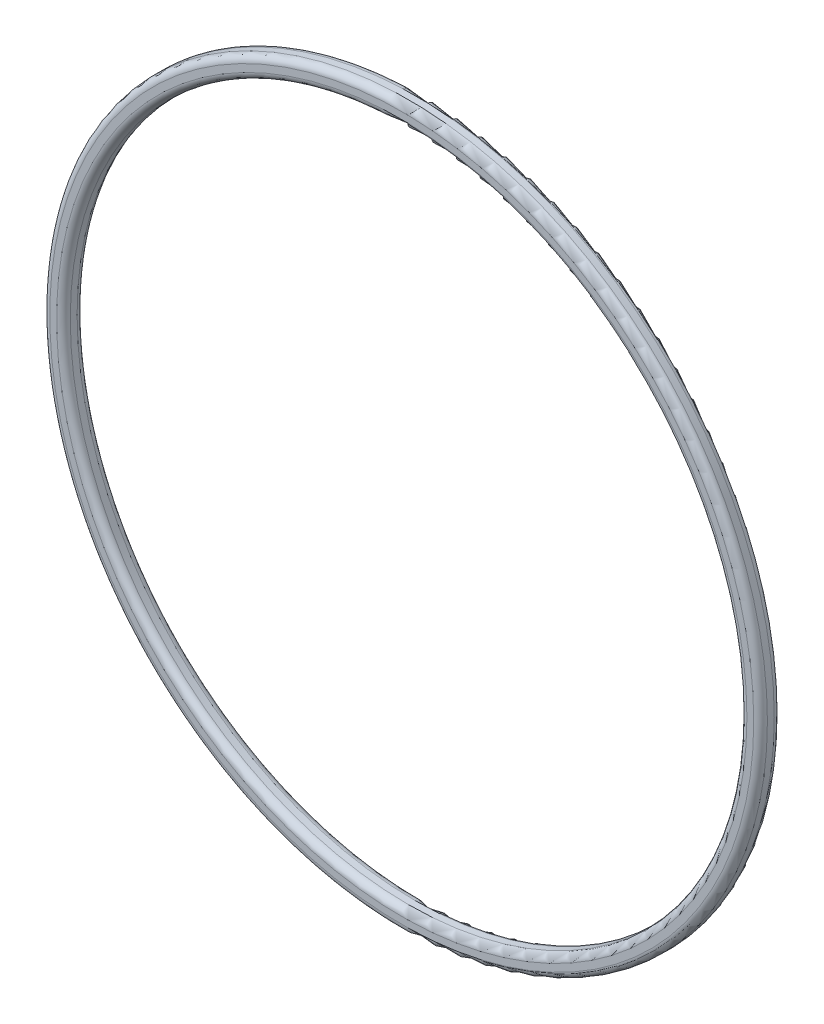
ISO-10303-21;
HEADER;
FILE_DESCRIPTION(('STEP AP214'),'2;1');
FILE_NAME('part.step','',(''),(''),'','','');
FILE_SCHEMA(('AUTOMOTIVE_DESIGN { 1 0 10303 214 1 1 1 1 }'));
ENDSEC;
DATA;
#1=APPLICATION_CONTEXT('core data for automotive mechanical design processes');
#2=APPLICATION_PROTOCOL_DEFINITION('international standard','automotive_design',2000,#1);
#3=PRODUCT_CONTEXT('',#1,'mechanical');
#4=PRODUCT('Part','Part','',(#3));
#5=PRODUCT_RELATED_PRODUCT_CATEGORY('part','',(#4));
#6=PRODUCT_DEFINITION_FORMATION('','',#4);
#7=PRODUCT_DEFINITION_CONTEXT('part definition',#1,'design');
#8=PRODUCT_DEFINITION('design','',#6,#7);
#9=PRODUCT_DEFINITION_SHAPE('','',#8);
#10=(LENGTH_UNIT() NAMED_UNIT(*) SI_UNIT(.MILLI.,.METRE.));
#11=(NAMED_UNIT(*) PLANE_ANGLE_UNIT() SI_UNIT($,.RADIAN.));
#12=(NAMED_UNIT(*) SI_UNIT($,.STERADIAN.) SOLID_ANGLE_UNIT());
#13=UNCERTAINTY_MEASURE_WITH_UNIT(LENGTH_MEASURE(1.E-05),#10,'distance_accuracy_value','');
#14=(GEOMETRIC_REPRESENTATION_CONTEXT(3) GLOBAL_UNCERTAINTY_ASSIGNED_CONTEXT((#13)) GLOBAL_UNIT_ASSIGNED_CONTEXT((#10,
#11,#12)) REPRESENTATION_CONTEXT('',''));
#15=CARTESIAN_POINT('',(0.,0.,0.));
#16=DIRECTION('',(0.,0.,1.));
#17=DIRECTION('',(1.,0.,0.));
#18=AXIS2_PLACEMENT_3D('',#15,#16,#17);
#19=CARTESIAN_POINT('',(0.,0.,3.));
#20=DIRECTION('',(0.,0.,1.));
#21=DIRECTION('',(1.,0.,0.));
#22=AXIS2_PLACEMENT_3D('',#19,#20,#21);
#23=PLANE('',#22);
#24=CARTESIAN_POINT('',(0.,0.,3.));
#25=DIRECTION('',(0.,0.,1.));
#26=DIRECTION('',(1.,0.,0.));
#27=AXIS2_PLACEMENT_3D('',#24,#25,#26);
#28=CIRCLE('',#27,50.5);
#29=CARTESIAN_POINT('',(50.5,0.,3.));
#30=VERTEX_POINT('',#29);
#31=EDGE_CURVE('E10',#30,#30,#28,.F.);
#32=ORIENTED_EDGE('',*,*,#31,.T.);
#33=EDGE_LOOP('',(#32));
#34=FACE_BOUND('',#33,.T.);
#35=CARTESIAN_POINT('',(0.,0.,3.));
#36=DIRECTION('',(0.,0.,1.));
#37=DIRECTION('',(1.,0.,0.));
#38=AXIS2_PLACEMENT_3D('',#35,#36,#37);
#39=CIRCLE('',#38,51.5);
#40=CARTESIAN_POINT('',(51.5,0.,3.));
#41=VERTEX_POINT('',#40);
#42=EDGE_CURVE('E45',#41,#41,#39,.T.);
#43=ORIENTED_EDGE('',*,*,#42,.T.);
#44=EDGE_LOOP('',(#43));
#45=FACE_BOUND('',#44,.T.);
#46=ADVANCED_FACE('F37',(#34,#45),#23,.T.);
#47=CARTESIAN_POINT('',(0.,0.,0.));
#48=DIRECTION('',(0.,0.,1.));
#49=DIRECTION('',(1.,0.,0.));
#50=AXIS2_PLACEMENT_3D('',#47,#48,#49);
#51=PLANE('',#50);
#52=CARTESIAN_POINT('',(0.,0.,0.));
#53=DIRECTION('',(0.,0.,1.));
#54=DIRECTION('',(1.,0.,0.));
#55=AXIS2_PLACEMENT_3D('',#52,#53,#54);
#56=CIRCLE('',#55,50.5);
#57=CARTESIAN_POINT('',(50.5,0.,0.));
#58=VERTEX_POINT('',#57);
#59=EDGE_CURVE('E69',#58,#58,#56,.T.);
#60=ORIENTED_EDGE('',*,*,#59,.T.);
#61=EDGE_LOOP('',(#60));
#62=FACE_BOUND('',#61,.T.);
#63=CARTESIAN_POINT('',(0.,0.,0.));
#64=DIRECTION('',(0.,0.,1.));
#65=DIRECTION('',(1.,0.,0.));
#66=AXIS2_PLACEMENT_3D('',#63,#64,#65);
#67=CIRCLE('',#66,51.5);
#68=CARTESIAN_POINT('',(51.5,0.,0.));
#69=VERTEX_POINT('',#68);
#70=EDGE_CURVE('E73',#69,#69,#67,.F.);
#71=ORIENTED_EDGE('',*,*,#70,.T.);
#72=EDGE_LOOP('',(#71));
#73=FACE_BOUND('',#72,.T.);
#74=ADVANCED_FACE('F78',(#62,#73),#51,.F.);
#75=CARTESIAN_POINT('',(0.,0.,3.));
#76=DIRECTION('',(0.,0.,-1.));
#77=DIRECTION('',(-1.,0.,0.));
#78=AXIS2_PLACEMENT_3D('',#75,#76,#77);
#79=CYLINDRICAL_SURFACE('',#78,52.5);
#80=CARTESIAN_POINT('',(0.,0.,1.));
#81=DIRECTION('',(0.,0.,1.));
#82=DIRECTION('',(1.,0.,0.));
#83=AXIS2_PLACEMENT_3D('',#80,#81,#82);
#84=CIRCLE('',#83,52.5);
#85=CARTESIAN_POINT('',(52.5,0.,1.));
#86=VERTEX_POINT('',#85);
#87=EDGE_CURVE('E50',#86,#86,#84,.T.);
#88=ORIENTED_EDGE('',*,*,#87,.T.);
#89=EDGE_LOOP('',(#88));
#90=FACE_BOUND('',#89,.T.);
#91=CARTESIAN_POINT('',(0.,0.,2.));
#92=DIRECTION('',(0.,0.,1.));
#93=DIRECTION('',(1.,0.,0.));
#94=AXIS2_PLACEMENT_3D('',#91,#92,#93);
#95=CIRCLE('',#94,52.5);
#96=CARTESIAN_POINT('',(52.5,0.,2.));
#97=VERTEX_POINT('',#96);
#98=EDGE_CURVE('E55',#97,#97,#95,.F.);
#99=ORIENTED_EDGE('',*,*,#98,.T.);
#100=EDGE_LOOP('',(#99));
#101=FACE_BOUND('',#100,.T.);
#102=ADVANCED_FACE('F88',(#90,#101),#79,.T.);
#103=CARTESIAN_POINT('',(0.,0.,3.));
#104=DIRECTION('',(0.,0.,-1.));
#105=DIRECTION('',(-1.,0.,0.));
#106=AXIS2_PLACEMENT_3D('',#103,#104,#105);
#107=CYLINDRICAL_SURFACE('',#106,49.5);
#108=CARTESIAN_POINT('',(0.,0.,1.));
#109=DIRECTION('',(0.,0.,1.));
#110=DIRECTION('',(1.,0.,0.));
#111=AXIS2_PLACEMENT_3D('',#108,#109,#110);
#112=CIRCLE('',#111,49.5);
#113=CARTESIAN_POINT('',(49.5,0.,1.));
#114=VERTEX_POINT('',#113);
#115=EDGE_CURVE('E61',#114,#114,#112,.F.);
#116=ORIENTED_EDGE('',*,*,#115,.T.);
#117=EDGE_LOOP('',(#116));
#118=FACE_BOUND('',#117,.T.);
#119=CARTESIAN_POINT('',(0.,0.,2.));
#120=DIRECTION('',(0.,0.,1.));
#121=DIRECTION('',(1.,0.,0.));
#122=AXIS2_PLACEMENT_3D('',#119,#120,#121);
#123=CIRCLE('',#122,49.5);
#124=CARTESIAN_POINT('',(49.5,0.,2.));
#125=VERTEX_POINT('',#124);
#126=EDGE_CURVE('E65',#125,#125,#123,.T.);
#127=ORIENTED_EDGE('',*,*,#126,.T.);
#128=EDGE_LOOP('',(#127));
#129=FACE_BOUND('',#128,.T.);
#130=ADVANCED_FACE('F91',(#118,#129),#107,.F.);
#131=CARTESIAN_POINT('',(0.,0.,1.));
#132=DIRECTION('',(0.,0.,1.));
#133=DIRECTION('',(1.,0.,0.));
#134=AXIS2_PLACEMENT_3D('',#131,#132,#133);
#135=TOROIDAL_SURFACE('',#134,50.5,1.);
#136=ORIENTED_EDGE('',*,*,#115,.F.);
#137=EDGE_LOOP('',(#136));
#138=FACE_BOUND('',#137,.T.);
#139=ORIENTED_EDGE('',*,*,#59,.F.);
#140=EDGE_LOOP('',(#139));
#141=FACE_BOUND('',#140,.T.);
#142=ADVANCED_FACE('F84',(#138,#141),#135,.T.);
#143=CARTESIAN_POINT('',(0.,0.,1.));
#144=DIRECTION('',(0.,0.,1.));
#145=DIRECTION('',(1.,0.,0.));
#146=AXIS2_PLACEMENT_3D('',#143,#144,#145);
#147=TOROIDAL_SURFACE('',#146,51.5,1.);
#148=ORIENTED_EDGE('',*,*,#70,.F.);
#149=EDGE_LOOP('',(#148));
#150=FACE_BOUND('',#149,.T.);
#151=ORIENTED_EDGE('',*,*,#87,.F.);
#152=EDGE_LOOP('',(#151));
#153=FACE_BOUND('',#152,.T.);
#154=ADVANCED_FACE('F80',(#150,#153),#147,.T.);
#155=CARTESIAN_POINT('',(0.,0.,2.));
#156=DIRECTION('',(0.,0.,1.));
#157=DIRECTION('',(1.,0.,0.));
#158=AXIS2_PLACEMENT_3D('',#155,#156,#157);
#159=TOROIDAL_SURFACE('',#158,50.5,1.);
#160=ORIENTED_EDGE('',*,*,#31,.F.);
#161=EDGE_LOOP('',(#160));
#162=FACE_BOUND('',#161,.T.);
#163=ORIENTED_EDGE('',*,*,#126,.F.);
#164=EDGE_LOOP('',(#163));
#165=FACE_BOUND('',#164,.T.);
#166=ADVANCED_FACE('F83',(#162,#165),#159,.T.);
#167=CARTESIAN_POINT('',(0.,0.,2.));
#168=DIRECTION('',(0.,0.,1.));
#169=DIRECTION('',(1.,0.,0.));
#170=AXIS2_PLACEMENT_3D('',#167,#168,#169);
#171=TOROIDAL_SURFACE('',#170,51.5,1.);
#172=ORIENTED_EDGE('',*,*,#98,.F.);
#173=EDGE_LOOP('',(#172));
#174=FACE_BOUND('',#173,.T.);
#175=ORIENTED_EDGE('',*,*,#42,.F.);
#176=EDGE_LOOP('',(#175));
#177=FACE_BOUND('',#176,.T.);
#178=ADVANCED_FACE('F39',(#174,#177),#171,.T.);
#179=CLOSED_SHELL('',(#46,#74,#102,#130,#142,#154,#166,#178));
#180=MANIFOLD_SOLID_BREP('B2',#179);
#181=ADVANCED_BREP_SHAPE_REPRESENTATION('',(#18,#180),#14);
#182=SHAPE_DEFINITION_REPRESENTATION(#9,#181);
ENDSEC;
END-ISO-10303-21;
